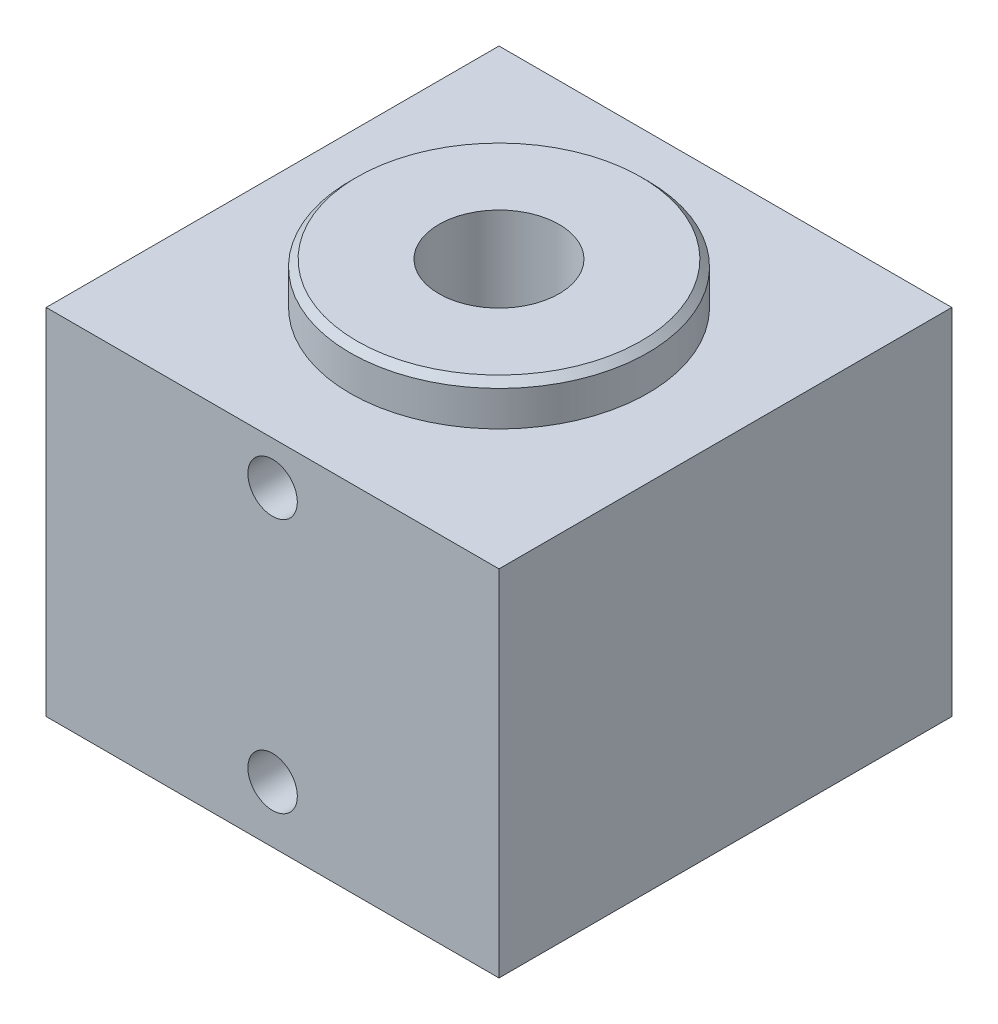
ISO-10303-21;
HEADER;
FILE_DESCRIPTION(('STEP AP214'),'2;1');
FILE_NAME('part.step','',(''),(''),'','','');
FILE_SCHEMA(('AUTOMOTIVE_DESIGN { 1 0 10303 214 1 1 1 1 }'));
ENDSEC;
DATA;
#1=APPLICATION_CONTEXT('core data for automotive mechanical design processes');
#2=APPLICATION_PROTOCOL_DEFINITION('international standard','automotive_design',2000,#1);
#3=PRODUCT_CONTEXT('',#1,'mechanical');
#4=PRODUCT('Part','Part','',(#3));
#5=PRODUCT_RELATED_PRODUCT_CATEGORY('part','',(#4));
#6=PRODUCT_DEFINITION_FORMATION('','',#4);
#7=PRODUCT_DEFINITION_CONTEXT('part definition',#1,'design');
#8=PRODUCT_DEFINITION('design','',#6,#7);
#9=PRODUCT_DEFINITION_SHAPE('','',#8);
#10=(LENGTH_UNIT() NAMED_UNIT(*) SI_UNIT(.MILLI.,.METRE.));
#11=(NAMED_UNIT(*) PLANE_ANGLE_UNIT() SI_UNIT($,.RADIAN.));
#12=(NAMED_UNIT(*) SI_UNIT($,.STERADIAN.) SOLID_ANGLE_UNIT());
#13=UNCERTAINTY_MEASURE_WITH_UNIT(LENGTH_MEASURE(1.E-05),#10,'distance_accuracy_value','');
#14=(GEOMETRIC_REPRESENTATION_CONTEXT(3) GLOBAL_UNCERTAINTY_ASSIGNED_CONTEXT((#13)) GLOBAL_UNIT_ASSIGNED_CONTEXT((#10,
#11,#12)) REPRESENTATION_CONTEXT('',''));
#15=CARTESIAN_POINT('',(0.,0.,0.));
#16=DIRECTION('',(0.,0.,1.));
#17=DIRECTION('',(1.,0.,0.));
#18=AXIS2_PLACEMENT_3D('',#15,#16,#17);
#19=CARTESIAN_POINT('',(-50.8,79.502,50.8));
#20=DIRECTION('',(0.,1.,0.));
#21=DIRECTION('',(0.,0.,1.));
#22=AXIS2_PLACEMENT_3D('',#19,#20,#21);
#23=PLANE('',#22);
#24=DIRECTION('',(0.,0.,1.));
#25=VECTOR('',#24,1.);
#26=CARTESIAN_POINT('',(-50.8,79.502,-50.8));
#27=LINE('',#26,#25);
#28=CARTESIAN_POINT('',(-50.8,79.502,-50.8));
#29=VERTEX_POINT('',#28);
#30=CARTESIAN_POINT('',(-50.8,79.502,50.8));
#31=VERTEX_POINT('',#30);
#32=EDGE_CURVE('E86',#29,#31,#27,.T.);
#33=ORIENTED_EDGE('',*,*,#32,.T.);
#34=DIRECTION('',(1.,0.,0.));
#35=VECTOR('',#34,1.);
#36=CARTESIAN_POINT('',(-50.8,79.502,50.8));
#37=LINE('',#36,#35);
#38=CARTESIAN_POINT('',(50.8,79.502,50.8));
#39=VERTEX_POINT('',#38);
#40=EDGE_CURVE('E81',#31,#39,#37,.T.);
#41=ORIENTED_EDGE('',*,*,#40,.T.);
#42=DIRECTION('',(0.,0.,-1.));
#43=VECTOR('',#42,1.);
#44=CARTESIAN_POINT('',(50.8,79.502,50.8));
#45=LINE('',#44,#43);
#46=CARTESIAN_POINT('',(50.8,79.502,-50.8));
#47=VERTEX_POINT('',#46);
#48=EDGE_CURVE('E84',#39,#47,#45,.T.);
#49=ORIENTED_EDGE('',*,*,#48,.T.);
#50=DIRECTION('',(-1.,0.,0.));
#51=VECTOR('',#50,1.);
#52=CARTESIAN_POINT('',(50.8,79.502,-50.8));
#53=LINE('',#52,#51);
#54=EDGE_CURVE('E50',#47,#29,#53,.T.);
#55=ORIENTED_EDGE('',*,*,#54,.T.);
#56=EDGE_LOOP('',(#33,#41,#49,#55));
#57=FACE_BOUND('',#56,.T.);
#58=CARTESIAN_POINT('',(0.,79.502,0.));
#59=DIRECTION('',(0.,1.,0.));
#60=DIRECTION('',(0.,0.,1.));
#61=AXIS2_PLACEMENT_3D('',#58,#59,#60);
#62=CIRCLE('',#61,33.401);
#63=CARTESIAN_POINT('',(0.,79.502,33.401));
#64=VERTEX_POINT('',#63);
#65=EDGE_CURVE('E104',#64,#64,#62,.T.);
#66=ORIENTED_EDGE('',*,*,#65,.F.);
#67=EDGE_LOOP('',(#66));
#68=FACE_BOUND('',#67,.T.);
#69=ADVANCED_FACE('F33',(#57,#68),#23,.T.);
#70=CARTESIAN_POINT('',(-50.8,79.502,-50.8));
#71=DIRECTION('',(1.,0.,0.));
#72=DIRECTION('',(0.,0.,-1.));
#73=AXIS2_PLACEMENT_3D('',#70,#71,#72);
#74=PLANE('',#73);
#75=DIRECTION('',(0.,0.,1.));
#76=VECTOR('',#75,1.);
#77=CARTESIAN_POINT('',(-50.8,0.,-50.8));
#78=LINE('',#77,#76);
#79=CARTESIAN_POINT('',(-50.8,0.,-50.8));
#80=VERTEX_POINT('',#79);
#81=CARTESIAN_POINT('',(-50.8,0.,50.8));
#82=VERTEX_POINT('',#81);
#83=EDGE_CURVE('E101',#80,#82,#78,.T.);
#84=ORIENTED_EDGE('',*,*,#83,.T.);
#85=DIRECTION('',(0.,-1.,0.));
#86=VECTOR('',#85,1.);
#87=CARTESIAN_POINT('',(-50.8,79.502,50.8));
#88=LINE('',#87,#86);
#89=EDGE_CURVE('E92',#31,#82,#88,.T.);
#90=ORIENTED_EDGE('',*,*,#89,.F.);
#91=ORIENTED_EDGE('',*,*,#32,.F.);
#92=DIRECTION('',(0.,-1.,0.));
#93=VECTOR('',#92,1.);
#94=CARTESIAN_POINT('',(-50.8,79.502,-50.8));
#95=LINE('',#94,#93);
#96=EDGE_CURVE('E97',#29,#80,#95,.T.);
#97=ORIENTED_EDGE('',*,*,#96,.T.);
#98=EDGE_LOOP('',(#84,#90,#91,#97));
#99=FACE_BOUND('',#98,.T.);
#100=ADVANCED_FACE('F130',(#99),#74,.F.);
#101=CARTESIAN_POINT('',(-50.8,79.502,50.8));
#102=DIRECTION('',(0.,0.,-1.));
#103=DIRECTION('',(-1.,0.,0.));
#104=AXIS2_PLACEMENT_3D('',#101,#102,#103);
#105=PLANE('',#104);
#106=CARTESIAN_POINT('',(0.,12.7,50.8));
#107=DIRECTION('',(0.,0.,1.));
#108=DIRECTION('',(1.,0.,0.));
#109=AXIS2_PLACEMENT_3D('',#106,#107,#108);
#110=CIRCLE('',#109,5.5499);
#111=CARTESIAN_POINT('',(5.5499,12.7,50.8));
#112=VERTEX_POINT('',#111);
#113=EDGE_CURVE('E154',#112,#112,#110,.T.);
#114=ORIENTED_EDGE('',*,*,#113,.F.);
#115=EDGE_LOOP('',(#114));
#116=FACE_BOUND('',#115,.T.);
#117=CARTESIAN_POINT('',(0.,69.85,50.8));
#118=DIRECTION('',(0.,0.,1.));
#119=DIRECTION('',(1.,0.,0.));
#120=AXIS2_PLACEMENT_3D('',#117,#118,#119);
#121=CIRCLE('',#120,5.5499);
#122=CARTESIAN_POINT('',(5.5499,69.85,50.8));
#123=VERTEX_POINT('',#122);
#124=EDGE_CURVE('E157',#123,#123,#121,.T.);
#125=ORIENTED_EDGE('',*,*,#124,.F.);
#126=EDGE_LOOP('',(#125));
#127=FACE_BOUND('',#126,.T.);
#128=DIRECTION('',(1.,0.,0.));
#129=VECTOR('',#128,1.);
#130=CARTESIAN_POINT('',(-50.8,0.,50.8));
#131=LINE('',#130,#129);
#132=CARTESIAN_POINT('',(50.8,0.,50.8));
#133=VERTEX_POINT('',#132);
#134=EDGE_CURVE('E91',#82,#133,#131,.T.);
#135=ORIENTED_EDGE('',*,*,#134,.T.);
#136=DIRECTION('',(0.,-1.,0.));
#137=VECTOR('',#136,1.);
#138=CARTESIAN_POINT('',(50.8,79.502,50.8));
#139=LINE('',#138,#137);
#140=EDGE_CURVE('E89',#39,#133,#139,.T.);
#141=ORIENTED_EDGE('',*,*,#140,.F.);
#142=ORIENTED_EDGE('',*,*,#40,.F.);
#143=ORIENTED_EDGE('',*,*,#89,.T.);
#144=EDGE_LOOP('',(#135,#141,#142,#143));
#145=FACE_BOUND('',#144,.T.);
#146=ADVANCED_FACE('F90',(#116,#127,#145),#105,.F.);
#147=CARTESIAN_POINT('',(50.8,79.502,50.8));
#148=DIRECTION('',(-1.,0.,0.));
#149=DIRECTION('',(0.,0.,1.));
#150=AXIS2_PLACEMENT_3D('',#147,#148,#149);
#151=PLANE('',#150);
#152=DIRECTION('',(0.,0.,-1.));
#153=VECTOR('',#152,1.);
#154=CARTESIAN_POINT('',(50.8,0.,50.8));
#155=LINE('',#154,#153);
#156=CARTESIAN_POINT('',(50.8,0.,-50.8));
#157=VERTEX_POINT('',#156);
#158=EDGE_CURVE('E67',#133,#157,#155,.T.);
#159=ORIENTED_EDGE('',*,*,#158,.T.);
#160=DIRECTION('',(0.,-1.,0.));
#161=VECTOR('',#160,1.);
#162=CARTESIAN_POINT('',(50.8,79.502,-50.8));
#163=LINE('',#162,#161);
#164=EDGE_CURVE('E93',#47,#157,#163,.T.);
#165=ORIENTED_EDGE('',*,*,#164,.F.);
#166=ORIENTED_EDGE('',*,*,#48,.F.);
#167=ORIENTED_EDGE('',*,*,#140,.T.);
#168=EDGE_LOOP('',(#159,#165,#166,#167));
#169=FACE_BOUND('',#168,.T.);
#170=ADVANCED_FACE('F95',(#169),#151,.F.);
#171=CARTESIAN_POINT('',(50.8,79.502,-50.8));
#172=DIRECTION('',(0.,0.,1.));
#173=DIRECTION('',(1.,0.,0.));
#174=AXIS2_PLACEMENT_3D('',#171,#172,#173);
#175=PLANE('',#174);
#176=DIRECTION('',(-1.,0.,0.));
#177=VECTOR('',#176,1.);
#178=CARTESIAN_POINT('',(50.8,0.,-50.8));
#179=LINE('',#178,#177);
#180=EDGE_CURVE('E73',#157,#80,#179,.T.);
#181=ORIENTED_EDGE('',*,*,#180,.T.);
#182=ORIENTED_EDGE('',*,*,#96,.F.);
#183=ORIENTED_EDGE('',*,*,#54,.F.);
#184=ORIENTED_EDGE('',*,*,#164,.T.);
#185=EDGE_LOOP('',(#181,#182,#183,#184));
#186=FACE_BOUND('',#185,.T.);
#187=ADVANCED_FACE('F141',(#186),#175,.F.);
#188=CARTESIAN_POINT('',(-50.8,0.,50.8));
#189=DIRECTION('',(0.,1.,0.));
#190=DIRECTION('',(0.,0.,1.));
#191=AXIS2_PLACEMENT_3D('',#188,#189,#190);
#192=PLANE('',#191);
#193=CARTESIAN_POINT('',(-38.1,0.,38.1));
#194=DIRECTION('',(0.,-1.,0.));
#195=DIRECTION('',(0.,0.,-1.));
#196=AXIS2_PLACEMENT_3D('',#193,#194,#195);
#197=CIRCLE('',#196,3.96875000000001);
#198=CARTESIAN_POINT('',(-38.1,0.,34.13125));
#199=VERTEX_POINT('',#198);
#200=EDGE_CURVE('E336',#199,#199,#197,.T.);
#201=ORIENTED_EDGE('',*,*,#200,.F.);
#202=EDGE_LOOP('',(#201));
#203=FACE_BOUND('',#202,.T.);
#204=CARTESIAN_POINT('',(38.1,0.,38.1));
#205=DIRECTION('',(0.,-1.,0.));
#206=DIRECTION('',(0.,0.,-1.));
#207=AXIS2_PLACEMENT_3D('',#204,#205,#206);
#208=CIRCLE('',#207,3.96875000000001);
#209=CARTESIAN_POINT('',(38.1,0.,34.13125));
#210=VERTEX_POINT('',#209);
#211=EDGE_CURVE('E338',#210,#210,#208,.T.);
#212=ORIENTED_EDGE('',*,*,#211,.F.);
#213=EDGE_LOOP('',(#212));
#214=FACE_BOUND('',#213,.T.);
#215=CARTESIAN_POINT('',(38.1,0.,-38.1));
#216=DIRECTION('',(0.,-1.,0.));
#217=DIRECTION('',(0.,0.,-1.));
#218=AXIS2_PLACEMENT_3D('',#215,#216,#217);
#219=CIRCLE('',#218,3.96875000000001);
#220=CARTESIAN_POINT('',(38.1,0.,-42.06875));
#221=VERTEX_POINT('',#220);
#222=EDGE_CURVE('E346',#221,#221,#219,.T.);
#223=ORIENTED_EDGE('',*,*,#222,.F.);
#224=EDGE_LOOP('',(#223));
#225=FACE_BOUND('',#224,.T.);
#226=CARTESIAN_POINT('',(-38.1,0.,-38.1));
#227=DIRECTION('',(0.,-1.,0.));
#228=DIRECTION('',(0.,0.,-1.));
#229=AXIS2_PLACEMENT_3D('',#226,#227,#228);
#230=CIRCLE('',#229,3.96875000000001);
#231=CARTESIAN_POINT('',(-38.1,0.,-42.06875));
#232=VERTEX_POINT('',#231);
#233=EDGE_CURVE('E352',#232,#232,#230,.T.);
#234=ORIENTED_EDGE('',*,*,#233,.F.);
#235=EDGE_LOOP('',(#234));
#236=FACE_BOUND('',#235,.T.);
#237=CARTESIAN_POINT('',(0.,0.,0.));
#238=DIRECTION('',(0.,1.,0.));
#239=DIRECTION('',(0.,0.,1.));
#240=AXIS2_PLACEMENT_3D('',#237,#238,#239);
#241=CIRCLE('',#240,13.4874);
#242=CARTESIAN_POINT('',(0.,0.,13.4874));
#243=VERTEX_POINT('',#242);
#244=EDGE_CURVE('E169',#243,#243,#241,.T.);
#245=ORIENTED_EDGE('',*,*,#244,.T.);
#246=EDGE_LOOP('',(#245));
#247=FACE_BOUND('',#246,.T.);
#248=ORIENTED_EDGE('',*,*,#83,.F.);
#249=ORIENTED_EDGE('',*,*,#180,.F.);
#250=ORIENTED_EDGE('',*,*,#158,.F.);
#251=ORIENTED_EDGE('',*,*,#134,.F.);
#252=EDGE_LOOP('',(#248,#249,#250,#251));
#253=FACE_BOUND('',#252,.T.);
#254=ADVANCED_FACE('F138',(#203,#214,#225,#236,#247,#253),#192,.F.);
#255=CARTESIAN_POINT('',(0.,88.9,0.));
#256=DIRECTION('',(0.,-1.,0.));
#257=DIRECTION('',(0.,0.,-1.));
#258=AXIS2_PLACEMENT_3D('',#255,#256,#257);
#259=CYLINDRICAL_SURFACE('',#258,33.401);
#260=CARTESIAN_POINT('',(0.,87.376,0.));
#261=DIRECTION('',(0.,1.,0.));
#262=DIRECTION('',(0.,0.,1.));
#263=AXIS2_PLACEMENT_3D('',#260,#261,#262);
#264=CIRCLE('',#263,33.401);
#265=CARTESIAN_POINT('',(0.,87.376,33.401));
#266=VERTEX_POINT('',#265);
#267=EDGE_CURVE('E11',#266,#266,#264,.F.);
#268=ORIENTED_EDGE('',*,*,#267,.T.);
#269=EDGE_LOOP('',(#268));
#270=FACE_BOUND('',#269,.T.);
#271=ORIENTED_EDGE('',*,*,#65,.T.);
#272=EDGE_LOOP('',(#271));
#273=FACE_BOUND('',#272,.T.);
#274=ADVANCED_FACE('F125',(#270,#273),#259,.T.);
#275=CARTESIAN_POINT('',(0.,88.9,0.));
#276=DIRECTION('',(0.,1.,0.));
#277=DIRECTION('',(0.,0.,1.));
#278=AXIS2_PLACEMENT_3D('',#275,#276,#277);
#279=PLANE('',#278);
#280=CARTESIAN_POINT('',(0.,88.9,0.));
#281=DIRECTION('',(0.,1.,0.));
#282=DIRECTION('',(0.,0.,1.));
#283=AXIS2_PLACEMENT_3D('',#280,#281,#282);
#284=CIRCLE('',#283,13.4874);
#285=CARTESIAN_POINT('',(0.,88.9,13.4874));
#286=VERTEX_POINT('',#285);
#287=EDGE_CURVE('E163',#286,#286,#284,.T.);
#288=ORIENTED_EDGE('',*,*,#287,.F.);
#289=EDGE_LOOP('',(#288));
#290=FACE_BOUND('',#289,.T.);
#291=CARTESIAN_POINT('',(0.,88.9,0.));
#292=DIRECTION('',(0.,1.,0.));
#293=DIRECTION('',(0.,0.,1.));
#294=AXIS2_PLACEMENT_3D('',#291,#292,#293);
#295=CIRCLE('',#294,31.877);
#296=CARTESIAN_POINT('',(0.,88.9,31.877));
#297=VERTEX_POINT('',#296);
#298=EDGE_CURVE('E42',#297,#297,#295,.T.);
#299=ORIENTED_EDGE('',*,*,#298,.T.);
#300=EDGE_LOOP('',(#299));
#301=FACE_BOUND('',#300,.T.);
#302=ADVANCED_FACE('F113',(#290,#301),#279,.T.);
#303=CARTESIAN_POINT('',(0.,88.9,0.));
#304=DIRECTION('',(0.,-1.,0.));
#305=DIRECTION('',(0.,0.,-1.));
#306=AXIS2_PLACEMENT_3D('',#303,#304,#305);
#307=CONICAL_SURFACE('',#306,31.877,0.785398163397453);
#308=ORIENTED_EDGE('',*,*,#267,.F.);
#309=EDGE_LOOP('',(#308));
#310=FACE_BOUND('',#309,.T.);
#311=ORIENTED_EDGE('',*,*,#298,.F.);
#312=EDGE_LOOP('',(#311));
#313=FACE_BOUND('',#312,.T.);
#314=ADVANCED_FACE('F35',(#310,#313),#307,.T.);
#315=CARTESIAN_POINT('',(0.,0.,0.));
#316=DIRECTION('',(0.,1.,0.));
#317=DIRECTION('',(0.,0.,1.));
#318=AXIS2_PLACEMENT_3D('',#315,#316,#317);
#319=CYLINDRICAL_SURFACE('',#318,13.4874);
#320=ORIENTED_EDGE('',*,*,#244,.F.);
#321=EDGE_LOOP('',(#320));
#322=FACE_BOUND('',#321,.T.);
#323=ORIENTED_EDGE('',*,*,#287,.T.);
#324=EDGE_LOOP('',(#323));
#325=FACE_BOUND('',#324,.T.);
#326=ADVANCED_FACE('F116',(#322,#325),#319,.F.);
#327=CARTESIAN_POINT('',(0.,69.85,38.1));
#328=DIRECTION('',(0.,0.,1.));
#329=DIRECTION('',(1.,0.,0.));
#330=AXIS2_PLACEMENT_3D('',#327,#328,#329);
#331=CYLINDRICAL_SURFACE('',#330,5.5499);
#332=CARTESIAN_POINT('',(0.,69.85,38.1));
#333=DIRECTION('',(0.,0.,1.));
#334=DIRECTION('',(1.,0.,0.));
#335=AXIS2_PLACEMENT_3D('',#332,#333,#334);
#336=CIRCLE('',#335,5.5499);
#337=CARTESIAN_POINT('',(5.5499,69.85,38.1));
#338=VERTEX_POINT('',#337);
#339=EDGE_CURVE('E159',#338,#338,#336,.T.);
#340=ORIENTED_EDGE('',*,*,#339,.F.);
#341=EDGE_LOOP('',(#340));
#342=FACE_BOUND('',#341,.T.);
#343=ORIENTED_EDGE('',*,*,#124,.T.);
#344=EDGE_LOOP('',(#343));
#345=FACE_BOUND('',#344,.T.);
#346=ADVANCED_FACE('F122',(#342,#345),#331,.F.);
#347=CARTESIAN_POINT('',(0.,69.85,38.1));
#348=DIRECTION('',(0.,0.,1.));
#349=DIRECTION('',(1.,0.,0.));
#350=AXIS2_PLACEMENT_3D('',#347,#348,#349);
#351=PLANE('',#350);
#352=ORIENTED_EDGE('',*,*,#339,.T.);
#353=EDGE_LOOP('',(#352));
#354=FACE_BOUND('',#353,.T.);
#355=ADVANCED_FACE('F210',(#354),#351,.T.);
#356=CARTESIAN_POINT('',(0.,12.7,38.1));
#357=DIRECTION('',(0.,0.,1.));
#358=DIRECTION('',(1.,0.,0.));
#359=AXIS2_PLACEMENT_3D('',#356,#357,#358);
#360=CYLINDRICAL_SURFACE('',#359,5.5499);
#361=CARTESIAN_POINT('',(0.,12.7,38.1));
#362=DIRECTION('',(0.,0.,1.));
#363=DIRECTION('',(1.,0.,0.));
#364=AXIS2_PLACEMENT_3D('',#361,#362,#363);
#365=CIRCLE('',#364,5.5499);
#366=CARTESIAN_POINT('',(5.5499,12.7,38.1));
#367=VERTEX_POINT('',#366);
#368=EDGE_CURVE('E160',#367,#367,#365,.T.);
#369=ORIENTED_EDGE('',*,*,#368,.F.);
#370=EDGE_LOOP('',(#369));
#371=FACE_BOUND('',#370,.T.);
#372=ORIENTED_EDGE('',*,*,#113,.T.);
#373=EDGE_LOOP('',(#372));
#374=FACE_BOUND('',#373,.T.);
#375=ADVANCED_FACE('F220',(#371,#374),#360,.F.);
#376=CARTESIAN_POINT('',(0.,12.7,38.1));
#377=DIRECTION('',(0.,0.,1.));
#378=DIRECTION('',(1.,0.,0.));
#379=AXIS2_PLACEMENT_3D('',#376,#377,#378);
#380=PLANE('',#379);
#381=ORIENTED_EDGE('',*,*,#368,.T.);
#382=EDGE_LOOP('',(#381));
#383=FACE_BOUND('',#382,.T.);
#384=ADVANCED_FACE('F230',(#383),#380,.T.);
#385=CARTESIAN_POINT('',(-38.1,12.7,-38.1));
#386=DIRECTION('',(0.,1.,0.));
#387=DIRECTION('',(0.,0.,1.));
#388=AXIS2_PLACEMENT_3D('',#385,#386,#387);
#389=PLANE('',#388);
#390=CARTESIAN_POINT('',(-38.1,12.7,-38.1));
#391=DIRECTION('',(0.,-1.,0.));
#392=DIRECTION('',(0.,0.,-1.));
#393=AXIS2_PLACEMENT_3D('',#390,#391,#392);
#394=CIRCLE('',#393,3.96875000000001);
#395=CARTESIAN_POINT('',(-38.1,12.7,-42.06875));
#396=VERTEX_POINT('',#395);
#397=EDGE_CURVE('E355',#396,#396,#394,.T.);
#398=ORIENTED_EDGE('',*,*,#397,.T.);
#399=EDGE_LOOP('',(#398));
#400=FACE_BOUND('',#399,.T.);
#401=ADVANCED_FACE('F239',(#400),#389,.F.);
#402=CARTESIAN_POINT('',(-38.1,0.,-38.1));
#403=DIRECTION('',(0.,-1.,0.));
#404=DIRECTION('',(0.,0.,-1.));
#405=AXIS2_PLACEMENT_3D('',#402,#403,#404);
#406=CYLINDRICAL_SURFACE('',#405,3.96875000000001);
#407=ORIENTED_EDGE('',*,*,#397,.F.);
#408=EDGE_LOOP('',(#407));
#409=FACE_BOUND('',#408,.T.);
#410=ORIENTED_EDGE('',*,*,#233,.T.);
#411=EDGE_LOOP('',(#410));
#412=FACE_BOUND('',#411,.T.);
#413=ADVANCED_FACE('F256',(#409,#412),#406,.F.);
#414=CARTESIAN_POINT('',(38.1,12.7,-38.1));
#415=DIRECTION('',(0.,1.,0.));
#416=DIRECTION('',(0.,0.,1.));
#417=AXIS2_PLACEMENT_3D('',#414,#415,#416);
#418=PLANE('',#417);
#419=CARTESIAN_POINT('',(38.1,12.7,-38.1));
#420=DIRECTION('',(0.,-1.,0.));
#421=DIRECTION('',(0.,0.,-1.));
#422=AXIS2_PLACEMENT_3D('',#419,#420,#421);
#423=CIRCLE('',#422,3.96875000000001);
#424=CARTESIAN_POINT('',(38.1,12.7,-42.06875));
#425=VERTEX_POINT('',#424);
#426=EDGE_CURVE('E349',#425,#425,#423,.T.);
#427=ORIENTED_EDGE('',*,*,#426,.T.);
#428=EDGE_LOOP('',(#427));
#429=FACE_BOUND('',#428,.T.);
#430=ADVANCED_FACE('F266',(#429),#418,.F.);
#431=CARTESIAN_POINT('',(38.1,0.,-38.1));
#432=DIRECTION('',(0.,-1.,0.));
#433=DIRECTION('',(0.,0.,-1.));
#434=AXIS2_PLACEMENT_3D('',#431,#432,#433);
#435=CYLINDRICAL_SURFACE('',#434,3.96875000000001);
#436=ORIENTED_EDGE('',*,*,#426,.F.);
#437=EDGE_LOOP('',(#436));
#438=FACE_BOUND('',#437,.T.);
#439=ORIENTED_EDGE('',*,*,#222,.T.);
#440=EDGE_LOOP('',(#439));
#441=FACE_BOUND('',#440,.T.);
#442=ADVANCED_FACE('F276',(#438,#441),#435,.F.);
#443=CARTESIAN_POINT('',(38.1,12.7,38.1));
#444=DIRECTION('',(0.,1.,0.));
#445=DIRECTION('',(0.,0.,1.));
#446=AXIS2_PLACEMENT_3D('',#443,#444,#445);
#447=PLANE('',#446);
#448=CARTESIAN_POINT('',(38.1,12.7,38.1));
#449=DIRECTION('',(0.,-1.,0.));
#450=DIRECTION('',(0.,0.,-1.));
#451=AXIS2_PLACEMENT_3D('',#448,#449,#450);
#452=CIRCLE('',#451,3.96875000000001);
#453=CARTESIAN_POINT('',(38.1,12.7,34.13125));
#454=VERTEX_POINT('',#453);
#455=EDGE_CURVE('E343',#454,#454,#452,.T.);
#456=ORIENTED_EDGE('',*,*,#455,.T.);
#457=EDGE_LOOP('',(#456));
#458=FACE_BOUND('',#457,.T.);
#459=ADVANCED_FACE('F286',(#458),#447,.F.);
#460=CARTESIAN_POINT('',(38.1,0.,38.1));
#461=DIRECTION('',(0.,-1.,0.));
#462=DIRECTION('',(0.,0.,-1.));
#463=AXIS2_PLACEMENT_3D('',#460,#461,#462);
#464=CYLINDRICAL_SURFACE('',#463,3.96875000000001);
#465=ORIENTED_EDGE('',*,*,#455,.F.);
#466=EDGE_LOOP('',(#465));
#467=FACE_BOUND('',#466,.T.);
#468=ORIENTED_EDGE('',*,*,#211,.T.);
#469=EDGE_LOOP('',(#468));
#470=FACE_BOUND('',#469,.T.);
#471=ADVANCED_FACE('F296',(#467,#470),#464,.F.);
#472=CARTESIAN_POINT('',(-38.1,12.7,38.1));
#473=DIRECTION('',(0.,1.,0.));
#474=DIRECTION('',(0.,0.,1.));
#475=AXIS2_PLACEMENT_3D('',#472,#473,#474);
#476=PLANE('',#475);
#477=CARTESIAN_POINT('',(-38.1,12.7,38.1));
#478=DIRECTION('',(0.,-1.,0.));
#479=DIRECTION('',(0.,0.,-1.));
#480=AXIS2_PLACEMENT_3D('',#477,#478,#479);
#481=CIRCLE('',#480,3.96875000000001);
#482=CARTESIAN_POINT('',(-38.1,12.7,34.13125));
#483=VERTEX_POINT('',#482);
#484=EDGE_CURVE('E333',#483,#483,#481,.T.);
#485=ORIENTED_EDGE('',*,*,#484,.T.);
#486=EDGE_LOOP('',(#485));
#487=FACE_BOUND('',#486,.T.);
#488=ADVANCED_FACE('F306',(#487),#476,.F.);
#489=CARTESIAN_POINT('',(-38.1,0.,38.1));
#490=DIRECTION('',(0.,-1.,0.));
#491=DIRECTION('',(0.,0.,-1.));
#492=AXIS2_PLACEMENT_3D('',#489,#490,#491);
#493=CYLINDRICAL_SURFACE('',#492,3.96875000000001);
#494=ORIENTED_EDGE('',*,*,#484,.F.);
#495=EDGE_LOOP('',(#494));
#496=FACE_BOUND('',#495,.T.);
#497=ORIENTED_EDGE('',*,*,#200,.T.);
#498=EDGE_LOOP('',(#497));
#499=FACE_BOUND('',#498,.T.);
#500=ADVANCED_FACE('F316',(#496,#499),#493,.F.);
#501=CLOSED_SHELL('',(#69,#100,#146,#170,#187,#254,#274,#302,#314,#326,#346,#355,#375,#384,#401,
#413,#430,#442,#459,#471,#488,#500));
#502=MANIFOLD_SOLID_BREP('B2',#501);
#503=ADVANCED_BREP_SHAPE_REPRESENTATION('',(#18,#502),#14);
#504=SHAPE_DEFINITION_REPRESENTATION(#9,#503);
ENDSEC;
END-ISO-10303-21;
